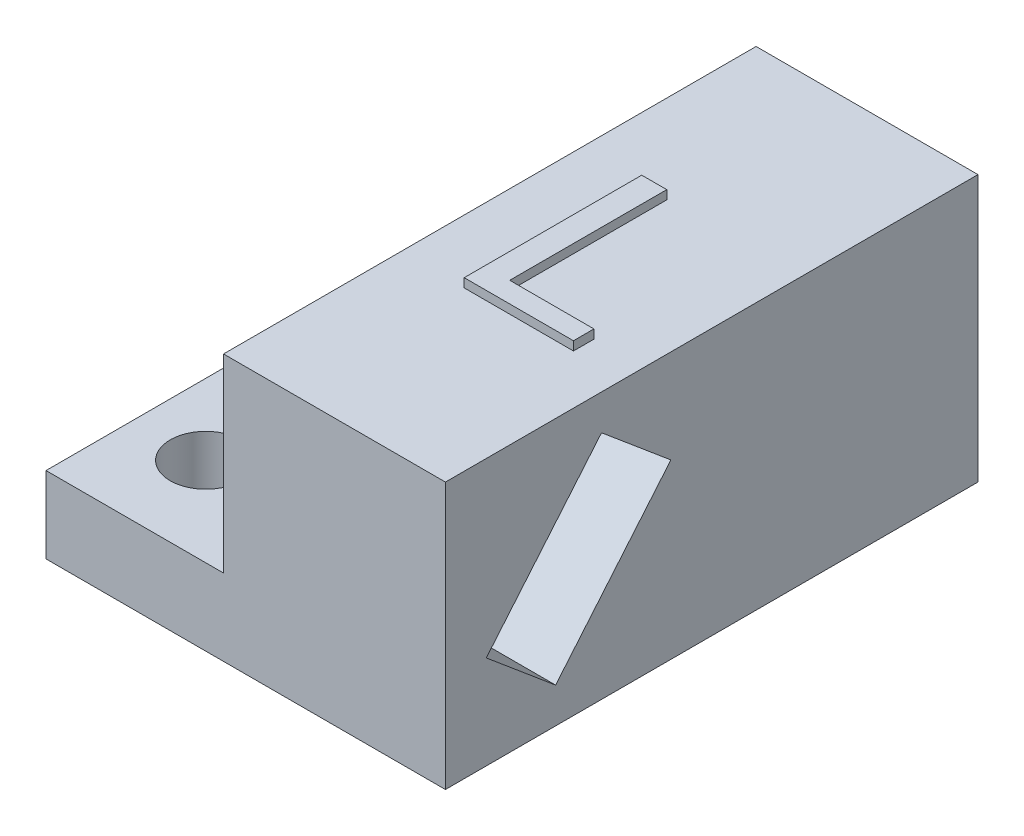
ISO-10303-21;
HEADER;
FILE_DESCRIPTION(('STEP AP214'),'2;1');
FILE_NAME('part.step','',(''),(''),'','','');
FILE_SCHEMA(('AUTOMOTIVE_DESIGN { 1 0 10303 214 1 1 1 1 }'));
ENDSEC;
DATA;
#1=APPLICATION_CONTEXT('core data for automotive mechanical design processes');
#2=APPLICATION_PROTOCOL_DEFINITION('international standard','automotive_design',2000,#1);
#3=PRODUCT_CONTEXT('',#1,'mechanical');
#4=PRODUCT('Part','Part','',(#3));
#5=PRODUCT_RELATED_PRODUCT_CATEGORY('part','',(#4));
#6=PRODUCT_DEFINITION_FORMATION('','',#4);
#7=PRODUCT_DEFINITION_CONTEXT('part definition',#1,'design');
#8=PRODUCT_DEFINITION('design','',#6,#7);
#9=PRODUCT_DEFINITION_SHAPE('','',#8);
#10=(LENGTH_UNIT() NAMED_UNIT(*) SI_UNIT(.MILLI.,.METRE.));
#11=(NAMED_UNIT(*) PLANE_ANGLE_UNIT() SI_UNIT($,.RADIAN.));
#12=(NAMED_UNIT(*) SI_UNIT($,.STERADIAN.) SOLID_ANGLE_UNIT());
#13=UNCERTAINTY_MEASURE_WITH_UNIT(LENGTH_MEASURE(1.E-05),#10,'distance_accuracy_value','');
#14=(GEOMETRIC_REPRESENTATION_CONTEXT(3) GLOBAL_UNCERTAINTY_ASSIGNED_CONTEXT((#13)) GLOBAL_UNIT_ASSIGNED_CONTEXT((#10,
#11,#12)) REPRESENTATION_CONTEXT('',''));
#15=CARTESIAN_POINT('',(0.,0.,0.));
#16=DIRECTION('',(0.,0.,1.));
#17=DIRECTION('',(1.,0.,0.));
#18=AXIS2_PLACEMENT_3D('',#15,#16,#17);
#19=CARTESIAN_POINT('',(-12.5,30.,30.));
#20=DIRECTION('',(1.,0.,0.));
#21=DIRECTION('',(0.,0.,-1.));
#22=AXIS2_PLACEMENT_3D('',#19,#20,#21);
#23=PLANE('',#22);
#24=DIRECTION('',(0.,0.,-1.));
#25=VECTOR('',#24,1.);
#26=CARTESIAN_POINT('',(-12.5,8.62381330552437,30.));
#27=LINE('',#26,#25);
#28=CARTESIAN_POINT('',(-12.5,8.62381330552437,30.));
#29=VERTEX_POINT('',#28);
#30=CARTESIAN_POINT('',(-12.5,8.62381330552437,-30.));
#31=VERTEX_POINT('',#30);
#32=EDGE_CURVE('E243',#29,#31,#27,.T.);
#33=ORIENTED_EDGE('',*,*,#32,.F.);
#34=DIRECTION('',(0.,-1.,0.));
#35=VECTOR('',#34,1.);
#36=CARTESIAN_POINT('',(-12.5,30.,30.));
#37=LINE('',#36,#35);
#38=CARTESIAN_POINT('',(-12.5,30.,30.));
#39=VERTEX_POINT('',#38);
#40=EDGE_CURVE('E11',#39,#29,#37,.T.);
#41=ORIENTED_EDGE('',*,*,#40,.F.);
#42=DIRECTION('',(0.,0.,1.));
#43=VECTOR('',#42,1.);
#44=CARTESIAN_POINT('',(-12.5,30.,30.));
#45=LINE('',#44,#43);
#46=CARTESIAN_POINT('',(-12.5,30.,-30.));
#47=VERTEX_POINT('',#46);
#48=EDGE_CURVE('E265',#47,#39,#45,.T.);
#49=ORIENTED_EDGE('',*,*,#48,.F.);
#50=DIRECTION('',(0.,-1.,0.));
#51=VECTOR('',#50,1.);
#52=CARTESIAN_POINT('',(-12.5,30.,-30.));
#53=LINE('',#52,#51);
#54=EDGE_CURVE('E275',#47,#31,#53,.T.);
#55=ORIENTED_EDGE('',*,*,#54,.T.);
#56=EDGE_LOOP('',(#33,#41,#49,#55));
#57=FACE_BOUND('',#56,.T.);
#58=ADVANCED_FACE('F35',(#57),#23,.F.);
#59=CARTESIAN_POINT('',(12.5,30.,30.));
#60=DIRECTION('',(0.,0.,-1.));
#61=DIRECTION('',(-1.,0.,0.));
#62=AXIS2_PLACEMENT_3D('',#59,#60,#61);
#63=PLANE('',#62);
#64=DIRECTION('',(1.,0.,0.));
#65=VECTOR('',#64,1.);
#66=CARTESIAN_POINT('',(12.5,0.,30.));
#67=LINE('',#66,#65);
#68=CARTESIAN_POINT('',(-32.5,0.,30.));
#69=VERTEX_POINT('',#68);
#70=CARTESIAN_POINT('',(12.5,0.,30.));
#71=VERTEX_POINT('',#70);
#72=EDGE_CURVE('E264',#69,#71,#67,.T.);
#73=ORIENTED_EDGE('',*,*,#72,.T.);
#74=DIRECTION('',(0.,-1.,0.));
#75=VECTOR('',#74,1.);
#76=CARTESIAN_POINT('',(12.5,30.,30.));
#77=LINE('',#76,#75);
#78=CARTESIAN_POINT('',(12.5,30.,30.));
#79=VERTEX_POINT('',#78);
#80=EDGE_CURVE('E42',#79,#71,#77,.T.);
#81=ORIENTED_EDGE('',*,*,#80,.F.);
#82=DIRECTION('',(1.,0.,0.));
#83=VECTOR('',#82,1.);
#84=CARTESIAN_POINT('',(12.5,30.,30.));
#85=LINE('',#84,#83);
#86=EDGE_CURVE('E268',#39,#79,#85,.T.);
#87=ORIENTED_EDGE('',*,*,#86,.F.);
#88=ORIENTED_EDGE('',*,*,#40,.T.);
#89=DIRECTION('',(1.,0.,0.));
#90=VECTOR('',#89,1.);
#91=CARTESIAN_POINT('',(-32.5,8.62381330552437,30.));
#92=LINE('',#91,#90);
#93=CARTESIAN_POINT('',(-32.5,8.62381330552437,30.));
#94=VERTEX_POINT('',#93);
#95=EDGE_CURVE('E261',#94,#29,#92,.T.);
#96=ORIENTED_EDGE('',*,*,#95,.F.);
#97=DIRECTION('',(0.,1.,0.));
#98=VECTOR('',#97,1.);
#99=CARTESIAN_POINT('',(-32.5,8.62381330552437,30.));
#100=LINE('',#99,#98);
#101=EDGE_CURVE('E252',#69,#94,#100,.T.);
#102=ORIENTED_EDGE('',*,*,#101,.F.);
#103=EDGE_LOOP('',(#73,#81,#87,#88,#96,#102));
#104=FACE_BOUND('',#103,.T.);
#105=ADVANCED_FACE('F304',(#104),#63,.F.);
#106=CARTESIAN_POINT('',(12.5,30.,30.));
#107=DIRECTION('',(-1.,0.,0.));
#108=DIRECTION('',(0.,0.,1.));
#109=AXIS2_PLACEMENT_3D('',#106,#107,#108);
#110=PLANE('',#109);
#111=DIRECTION('',(0.,0.766044443118982,-0.642787609686535));
#112=VECTOR('',#111,1.);
#113=CARTESIAN_POINT('',(12.5,3.98473431509697,17.5853281979272));
#114=LINE('',#113,#112);
#115=CARTESIAN_POINT('',(12.5,3.98473431509697,17.5853281979272));
#116=VERTEX_POINT('',#115);
#117=CARTESIAN_POINT('',(12.5,19.4588320661004,4.60101848225919));
#118=VERTEX_POINT('',#117);
#119=EDGE_CURVE('E217',#116,#118,#114,.T.);
#120=ORIENTED_EDGE('',*,*,#119,.F.);
#121=DIRECTION('',(0.,-0.642787609686535,-0.766044443118982));
#122=VECTOR('',#121,1.);
#123=CARTESIAN_POINT('',(12.5,3.98473431509697,17.5853281979272));
#124=LINE('',#123,#122);
#125=CARTESIAN_POINT('',(12.5,10.5411679338996,25.3989815177408));
#126=VERTEX_POINT('',#125);
#127=EDGE_CURVE('E192',#126,#116,#124,.T.);
#128=ORIENTED_EDGE('',*,*,#127,.F.);
#129=DIRECTION('',(0.,-0.766044443118982,0.642787609686535));
#130=VECTOR('',#129,1.);
#131=CARTESIAN_POINT('',(12.5,10.5411679338996,25.3989815177408));
#132=LINE('',#131,#130);
#133=CARTESIAN_POINT('',(12.5,26.015265684903,12.4146718020728));
#134=VERTEX_POINT('',#133);
#135=EDGE_CURVE('E206',#134,#126,#132,.T.);
#136=ORIENTED_EDGE('',*,*,#135,.F.);
#137=DIRECTION('',(0.,0.642787609686535,0.766044443118982));
#138=VECTOR('',#137,1.);
#139=CARTESIAN_POINT('',(12.5,19.4588320661004,4.60101848225919));
#140=LINE('',#139,#138);
#141=EDGE_CURVE('E220',#118,#134,#140,.T.);
#142=ORIENTED_EDGE('',*,*,#141,.F.);
#143=EDGE_LOOP('',(#120,#128,#136,#142));
#144=FACE_BOUND('',#143,.T.);
#145=DIRECTION('',(0.,0.,-1.));
#146=VECTOR('',#145,1.);
#147=CARTESIAN_POINT('',(12.5,0.,30.));
#148=LINE('',#147,#146);
#149=CARTESIAN_POINT('',(12.5,0.,-30.));
#150=VERTEX_POINT('',#149);
#151=EDGE_CURVE('E277',#71,#150,#148,.T.);
#152=ORIENTED_EDGE('',*,*,#151,.T.);
#153=DIRECTION('',(0.,-1.,0.));
#154=VECTOR('',#153,1.);
#155=CARTESIAN_POINT('',(12.5,30.,-30.));
#156=LINE('',#155,#154);
#157=CARTESIAN_POINT('',(12.5,30.,-30.));
#158=VERTEX_POINT('',#157);
#159=EDGE_CURVE('E281',#158,#150,#156,.T.);
#160=ORIENTED_EDGE('',*,*,#159,.F.);
#161=DIRECTION('',(0.,0.,-1.));
#162=VECTOR('',#161,1.);
#163=CARTESIAN_POINT('',(12.5,30.,30.));
#164=LINE('',#163,#162);
#165=EDGE_CURVE('E271',#79,#158,#164,.T.);
#166=ORIENTED_EDGE('',*,*,#165,.F.);
#167=ORIENTED_EDGE('',*,*,#80,.T.);
#168=EDGE_LOOP('',(#152,#160,#166,#167));
#169=FACE_BOUND('',#168,.T.);
#170=ADVANCED_FACE('F288',(#144,#169),#110,.F.);
#171=CARTESIAN_POINT('',(12.5,30.,-30.));
#172=DIRECTION('',(0.,0.,1.));
#173=DIRECTION('',(1.,0.,0.));
#174=AXIS2_PLACEMENT_3D('',#171,#172,#173);
#175=PLANE('',#174);
#176=DIRECTION('',(-1.,0.,0.));
#177=VECTOR('',#176,1.);
#178=CARTESIAN_POINT('',(12.5,0.,-30.));
#179=LINE('',#178,#177);
#180=CARTESIAN_POINT('',(-32.5,0.,-30.));
#181=VERTEX_POINT('',#180);
#182=EDGE_CURVE('E269',#150,#181,#179,.T.);
#183=ORIENTED_EDGE('',*,*,#182,.T.);
#184=DIRECTION('',(0.,-1.,0.));
#185=VECTOR('',#184,1.);
#186=CARTESIAN_POINT('',(-32.5,8.62381330552437,-30.));
#187=LINE('',#186,#185);
#188=CARTESIAN_POINT('',(-32.5,8.62381330552437,-30.));
#189=VERTEX_POINT('',#188);
#190=EDGE_CURVE('E246',#189,#181,#187,.T.);
#191=ORIENTED_EDGE('',*,*,#190,.F.);
#192=DIRECTION('',(1.,0.,0.));
#193=VECTOR('',#192,1.);
#194=CARTESIAN_POINT('',(-32.5,8.62381330552437,-30.));
#195=LINE('',#194,#193);
#196=EDGE_CURVE('E256',#189,#31,#195,.T.);
#197=ORIENTED_EDGE('',*,*,#196,.T.);
#198=ORIENTED_EDGE('',*,*,#54,.F.);
#199=DIRECTION('',(-1.,0.,0.));
#200=VECTOR('',#199,1.);
#201=CARTESIAN_POINT('',(12.5,30.,-30.));
#202=LINE('',#201,#200);
#203=EDGE_CURVE('E273',#158,#47,#202,.T.);
#204=ORIENTED_EDGE('',*,*,#203,.F.);
#205=ORIENTED_EDGE('',*,*,#159,.T.);
#206=EDGE_LOOP('',(#183,#191,#197,#198,#204,#205));
#207=FACE_BOUND('',#206,.T.);
#208=ADVANCED_FACE('F297',(#207),#175,.F.);
#209=CARTESIAN_POINT('',(0.,30.,0.));
#210=DIRECTION('',(0.,1.,0.));
#211=DIRECTION('',(0.,0.,1.));
#212=AXIS2_PLACEMENT_3D('',#209,#210,#211);
#213=PLANE('',#212);
#214=DIRECTION('',(-1.,0.,0.));
#215=VECTOR('',#214,1.);
#216=CARTESIAN_POINT('',(6.92307692307692,30.,10.));
#217=LINE('',#216,#215);
#218=CARTESIAN_POINT('',(6.92307692307692,30.,10.));
#219=VERTEX_POINT('',#218);
#220=CARTESIAN_POINT('',(-5.38461538461539,30.,10.));
#221=VERTEX_POINT('',#220);
#222=EDGE_CURVE('E183',#219,#221,#217,.T.);
#223=ORIENTED_EDGE('',*,*,#222,.T.);
#224=DIRECTION('',(0.,0.,-1.));
#225=VECTOR('',#224,1.);
#226=CARTESIAN_POINT('',(-5.38461538461539,30.,10.));
#227=LINE('',#226,#225);
#228=CARTESIAN_POINT('',(-5.38461538461539,30.,-10.));
#229=VERTEX_POINT('',#228);
#230=EDGE_CURVE('E152',#221,#229,#227,.T.);
#231=ORIENTED_EDGE('',*,*,#230,.T.);
#232=DIRECTION('',(1.,0.,0.));
#233=VECTOR('',#232,1.);
#234=CARTESIAN_POINT('',(-5.38461538461539,30.,-10.));
#235=LINE('',#234,#233);
#236=CARTESIAN_POINT('',(-2.56410256410257,30.,-10.));
#237=VERTEX_POINT('',#236);
#238=EDGE_CURVE('E186',#229,#237,#235,.T.);
#239=ORIENTED_EDGE('',*,*,#238,.T.);
#240=DIRECTION('',(0.,0.,1.));
#241=VECTOR('',#240,1.);
#242=CARTESIAN_POINT('',(-2.56410256410257,30.,-10.));
#243=LINE('',#242,#241);
#244=CARTESIAN_POINT('',(-2.56410256410257,30.,7.69230769230769));
#245=VERTEX_POINT('',#244);
#246=EDGE_CURVE('E188',#237,#245,#243,.T.);
#247=ORIENTED_EDGE('',*,*,#246,.T.);
#248=DIRECTION('',(1.,0.,0.));
#249=VECTOR('',#248,1.);
#250=CARTESIAN_POINT('',(-2.56410256410257,30.,7.69230769230769));
#251=LINE('',#250,#249);
#252=CARTESIAN_POINT('',(6.92307692307692,30.,7.69230769230769));
#253=VERTEX_POINT('',#252);
#254=EDGE_CURVE('E54',#245,#253,#251,.T.);
#255=ORIENTED_EDGE('',*,*,#254,.T.);
#256=DIRECTION('',(0.,0.,1.));
#257=VECTOR('',#256,1.);
#258=CARTESIAN_POINT('',(6.92307692307692,30.,7.69230769230769));
#259=LINE('',#258,#257);
#260=EDGE_CURVE('E49',#253,#219,#259,.T.);
#261=ORIENTED_EDGE('',*,*,#260,.T.);
#262=EDGE_LOOP('',(#223,#231,#239,#247,#255,#261));
#263=FACE_BOUND('',#262,.T.);
#264=ORIENTED_EDGE('',*,*,#48,.T.);
#265=ORIENTED_EDGE('',*,*,#86,.T.);
#266=ORIENTED_EDGE('',*,*,#165,.T.);
#267=ORIENTED_EDGE('',*,*,#203,.T.);
#268=EDGE_LOOP('',(#264,#265,#266,#267));
#269=FACE_BOUND('',#268,.T.);
#270=ADVANCED_FACE('F302',(#263,#269),#213,.T.);
#271=CARTESIAN_POINT('',(0.,0.,0.));
#272=DIRECTION('',(0.,1.,0.));
#273=DIRECTION('',(0.,0.,1.));
#274=AXIS2_PLACEMENT_3D('',#271,#272,#273);
#275=PLANE('',#274);
#276=CARTESIAN_POINT('',(-24.5,0.,20.));
#277=DIRECTION('',(0.,1.,0.));
#278=DIRECTION('',(0.,0.,1.));
#279=AXIS2_PLACEMENT_3D('',#276,#277,#278);
#280=CIRCLE('',#279,4.);
#281=CARTESIAN_POINT('',(-24.5,0.,24.));
#282=VERTEX_POINT('',#281);
#283=EDGE_CURVE('E234',#282,#282,#280,.T.);
#284=ORIENTED_EDGE('',*,*,#283,.T.);
#285=EDGE_LOOP('',(#284));
#286=FACE_BOUND('',#285,.T.);
#287=CARTESIAN_POINT('',(-24.5,0.,-20.));
#288=DIRECTION('',(0.,1.,0.));
#289=DIRECTION('',(0.,0.,1.));
#290=AXIS2_PLACEMENT_3D('',#287,#288,#289);
#291=CIRCLE('',#290,4.);
#292=CARTESIAN_POINT('',(-24.5,0.,-16.));
#293=VERTEX_POINT('',#292);
#294=EDGE_CURVE('E240',#293,#293,#291,.T.);
#295=ORIENTED_EDGE('',*,*,#294,.T.);
#296=EDGE_LOOP('',(#295));
#297=FACE_BOUND('',#296,.T.);
#298=ORIENTED_EDGE('',*,*,#72,.F.);
#299=DIRECTION('',(0.,0.,1.));
#300=VECTOR('',#299,1.);
#301=CARTESIAN_POINT('',(-32.5,0.,30.));
#302=LINE('',#301,#300);
#303=EDGE_CURVE('E249',#181,#69,#302,.T.);
#304=ORIENTED_EDGE('',*,*,#303,.F.);
#305=ORIENTED_EDGE('',*,*,#182,.F.);
#306=ORIENTED_EDGE('',*,*,#151,.F.);
#307=EDGE_LOOP('',(#298,#304,#305,#306));
#308=FACE_BOUND('',#307,.T.);
#309=ADVANCED_FACE('F293',(#286,#297,#308),#275,.F.);
#310=CARTESIAN_POINT('',(-32.5,8.62381330552437,30.));
#311=DIRECTION('',(0.,-1.,0.));
#312=DIRECTION('',(0.,0.,-1.));
#313=AXIS2_PLACEMENT_3D('',#310,#311,#312);
#314=PLANE('',#313);
#315=CARTESIAN_POINT('',(-24.5,8.62381330552437,20.));
#316=DIRECTION('',(0.,1.,0.));
#317=DIRECTION('',(0.,0.,1.));
#318=AXIS2_PLACEMENT_3D('',#315,#316,#317);
#319=CIRCLE('',#318,4.);
#320=CARTESIAN_POINT('',(-24.5,8.62381330552437,24.));
#321=VERTEX_POINT('',#320);
#322=EDGE_CURVE('E227',#321,#321,#319,.T.);
#323=ORIENTED_EDGE('',*,*,#322,.F.);
#324=EDGE_LOOP('',(#323));
#325=FACE_BOUND('',#324,.T.);
#326=CARTESIAN_POINT('',(-24.5,8.62381330552437,-20.));
#327=DIRECTION('',(0.,1.,0.));
#328=DIRECTION('',(0.,0.,1.));
#329=AXIS2_PLACEMENT_3D('',#326,#327,#328);
#330=CIRCLE('',#329,4.);
#331=CARTESIAN_POINT('',(-24.5,8.62381330552437,-16.));
#332=VERTEX_POINT('',#331);
#333=EDGE_CURVE('E237',#332,#332,#330,.T.);
#334=ORIENTED_EDGE('',*,*,#333,.F.);
#335=EDGE_LOOP('',(#334));
#336=FACE_BOUND('',#335,.T.);
#337=ORIENTED_EDGE('',*,*,#32,.T.);
#338=ORIENTED_EDGE('',*,*,#196,.F.);
#339=DIRECTION('',(0.,0.,-1.));
#340=VECTOR('',#339,1.);
#341=CARTESIAN_POINT('',(-32.5,8.62381330552437,30.));
#342=LINE('',#341,#340);
#343=EDGE_CURVE('E254',#94,#189,#342,.T.);
#344=ORIENTED_EDGE('',*,*,#343,.F.);
#345=ORIENTED_EDGE('',*,*,#95,.T.);
#346=EDGE_LOOP('',(#337,#338,#344,#345));
#347=FACE_BOUND('',#346,.T.);
#348=ADVANCED_FACE('F310',(#325,#336,#347),#314,.F.);
#349=CARTESIAN_POINT('',(-32.5,0.,0.));
#350=DIRECTION('',(1.,0.,0.));
#351=DIRECTION('',(0.,0.,-1.));
#352=AXIS2_PLACEMENT_3D('',#349,#350,#351);
#353=PLANE('',#352);
#354=ORIENTED_EDGE('',*,*,#190,.T.);
#355=ORIENTED_EDGE('',*,*,#303,.T.);
#356=ORIENTED_EDGE('',*,*,#101,.T.);
#357=ORIENTED_EDGE('',*,*,#343,.T.);
#358=EDGE_LOOP('',(#354,#355,#356,#357));
#359=FACE_BOUND('',#358,.T.);
#360=ADVANCED_FACE('F313',(#359),#353,.F.);
#361=CARTESIAN_POINT('',(-24.5,0.,-20.));
#362=DIRECTION('',(0.,1.,0.));
#363=DIRECTION('',(0.,0.,1.));
#364=AXIS2_PLACEMENT_3D('',#361,#362,#363);
#365=CYLINDRICAL_SURFACE('',#364,4.);
#366=ORIENTED_EDGE('',*,*,#294,.F.);
#367=EDGE_LOOP('',(#366));
#368=FACE_BOUND('',#367,.T.);
#369=ORIENTED_EDGE('',*,*,#333,.T.);
#370=EDGE_LOOP('',(#369));
#371=FACE_BOUND('',#370,.T.);
#372=ADVANCED_FACE('F315',(#368,#371),#365,.F.);
#373=CARTESIAN_POINT('',(-24.5,0.,20.));
#374=DIRECTION('',(0.,1.,0.));
#375=DIRECTION('',(0.,0.,1.));
#376=AXIS2_PLACEMENT_3D('',#373,#374,#375);
#377=CYLINDRICAL_SURFACE('',#376,4.);
#378=ORIENTED_EDGE('',*,*,#283,.F.);
#379=EDGE_LOOP('',(#378));
#380=FACE_BOUND('',#379,.T.);
#381=ORIENTED_EDGE('',*,*,#322,.T.);
#382=EDGE_LOOP('',(#381));
#383=FACE_BOUND('',#382,.T.);
#384=ADVANCED_FACE('F321',(#380,#383),#377,.F.);
#385=CARTESIAN_POINT('',(-7.5,3.98473431509697,17.5853281979272));
#386=DIRECTION('',(0.,-0.766044443118982,0.642787609686535));
#387=DIRECTION('',(0.,-0.642787609686535,-0.766044443118982));
#388=AXIS2_PLACEMENT_3D('',#385,#386,#387);
#389=PLANE('',#388);
#390=ORIENTED_EDGE('',*,*,#127,.T.);
#391=DIRECTION('',(1.,0.,0.));
#392=VECTOR('',#391,1.);
#393=CARTESIAN_POINT('',(-7.5,3.98473431509697,17.5853281979272));
#394=LINE('',#393,#392);
#395=CARTESIAN_POINT('',(-7.5,3.98473431509697,17.5853281979272));
#396=VERTEX_POINT('',#395);
#397=EDGE_CURVE('E215',#396,#116,#394,.T.);
#398=ORIENTED_EDGE('',*,*,#397,.F.);
#399=DIRECTION('',(0.,-0.642787609686535,-0.766044443118982));
#400=VECTOR('',#399,1.);
#401=CARTESIAN_POINT('',(-7.5,3.98473431509697,17.5853281979272));
#402=LINE('',#401,#400);
#403=CARTESIAN_POINT('',(-7.5,10.5411679338996,25.3989815177408));
#404=VERTEX_POINT('',#403);
#405=EDGE_CURVE('E202',#404,#396,#402,.T.);
#406=ORIENTED_EDGE('',*,*,#405,.F.);
#407=DIRECTION('',(1.,0.,0.));
#408=VECTOR('',#407,1.);
#409=CARTESIAN_POINT('',(-7.5,10.5411679338996,25.3989815177408));
#410=LINE('',#409,#408);
#411=EDGE_CURVE('E225',#404,#126,#410,.T.);
#412=ORIENTED_EDGE('',*,*,#411,.T.);
#413=EDGE_LOOP('',(#390,#398,#406,#412));
#414=FACE_BOUND('',#413,.T.);
#415=ADVANCED_FACE('F380',(#414),#389,.F.);
#416=CARTESIAN_POINT('',(-7.5,10.5411679338996,25.3989815177408));
#417=DIRECTION('',(0.,0.642787609686535,0.766044443118982));
#418=DIRECTION('',(0.,-0.766044443118982,0.642787609686535));
#419=AXIS2_PLACEMENT_3D('',#416,#417,#418);
#420=PLANE('',#419);
#421=ORIENTED_EDGE('',*,*,#135,.T.);
#422=ORIENTED_EDGE('',*,*,#411,.F.);
#423=DIRECTION('',(0.,-0.766044443118982,0.642787609686535));
#424=VECTOR('',#423,1.);
#425=CARTESIAN_POINT('',(-7.5,10.5411679338996,25.3989815177408));
#426=LINE('',#425,#424);
#427=CARTESIAN_POINT('',(-7.5,26.015265684903,12.4146718020728));
#428=VERTEX_POINT('',#427);
#429=EDGE_CURVE('E212',#428,#404,#426,.T.);
#430=ORIENTED_EDGE('',*,*,#429,.F.);
#431=DIRECTION('',(1.,0.,0.));
#432=VECTOR('',#431,1.);
#433=CARTESIAN_POINT('',(-7.5,26.015265684903,12.4146718020728));
#434=LINE('',#433,#432);
#435=EDGE_CURVE('E228',#428,#134,#434,.T.);
#436=ORIENTED_EDGE('',*,*,#435,.T.);
#437=EDGE_LOOP('',(#421,#422,#430,#436));
#438=FACE_BOUND('',#437,.T.);
#439=ADVANCED_FACE('F376',(#438),#420,.F.);
#440=CARTESIAN_POINT('',(-7.5,19.4588320661004,4.60101848225919));
#441=DIRECTION('',(0.,0.766044443118982,-0.642787609686535));
#442=DIRECTION('',(0.,0.642787609686535,0.766044443118982));
#443=AXIS2_PLACEMENT_3D('',#440,#441,#442);
#444=PLANE('',#443);
#445=ORIENTED_EDGE('',*,*,#141,.T.);
#446=ORIENTED_EDGE('',*,*,#435,.F.);
#447=DIRECTION('',(0.,0.642787609686535,0.766044443118982));
#448=VECTOR('',#447,1.);
#449=CARTESIAN_POINT('',(-7.5,19.4588320661004,4.60101848225919));
#450=LINE('',#449,#448);
#451=CARTESIAN_POINT('',(-7.5,19.4588320661004,4.60101848225919));
#452=VERTEX_POINT('',#451);
#453=EDGE_CURVE('E209',#452,#428,#450,.T.);
#454=ORIENTED_EDGE('',*,*,#453,.F.);
#455=DIRECTION('',(1.,0.,0.));
#456=VECTOR('',#455,1.);
#457=CARTESIAN_POINT('',(-7.5,19.4588320661004,4.60101848225919));
#458=LINE('',#457,#456);
#459=EDGE_CURVE('E230',#452,#118,#458,.T.);
#460=ORIENTED_EDGE('',*,*,#459,.T.);
#461=EDGE_LOOP('',(#445,#446,#454,#460));
#462=FACE_BOUND('',#461,.T.);
#463=ADVANCED_FACE('F379',(#462),#444,.F.);
#464=CARTESIAN_POINT('',(-7.5,3.98473431509697,17.5853281979272));
#465=DIRECTION('',(0.,-0.642787609686535,-0.766044443118982));
#466=DIRECTION('',(0.,0.766044443118982,-0.642787609686535));
#467=AXIS2_PLACEMENT_3D('',#464,#465,#466);
#468=PLANE('',#467);
#469=ORIENTED_EDGE('',*,*,#119,.T.);
#470=ORIENTED_EDGE('',*,*,#459,.F.);
#471=DIRECTION('',(0.,0.766044443118982,-0.642787609686535));
#472=VECTOR('',#471,1.);
#473=CARTESIAN_POINT('',(-7.5,3.98473431509697,17.5853281979272));
#474=LINE('',#473,#472);
#475=EDGE_CURVE('E205',#396,#452,#474,.T.);
#476=ORIENTED_EDGE('',*,*,#475,.F.);
#477=ORIENTED_EDGE('',*,*,#397,.T.);
#478=EDGE_LOOP('',(#469,#470,#476,#477));
#479=FACE_BOUND('',#478,.T.);
#480=ADVANCED_FACE('F374',(#479),#468,.F.);
#481=CARTESIAN_POINT('',(-7.5,0.,0.));
#482=DIRECTION('',(-1.,0.,0.));
#483=DIRECTION('',(0.,0.,1.));
#484=AXIS2_PLACEMENT_3D('',#481,#482,#483);
#485=PLANE('',#484);
#486=ORIENTED_EDGE('',*,*,#405,.T.);
#487=ORIENTED_EDGE('',*,*,#475,.T.);
#488=ORIENTED_EDGE('',*,*,#453,.T.);
#489=ORIENTED_EDGE('',*,*,#429,.T.);
#490=EDGE_LOOP('',(#486,#487,#488,#489));
#491=FACE_BOUND('',#490,.T.);
#492=ADVANCED_FACE('F362',(#491),#485,.F.);
#493=CARTESIAN_POINT('',(6.92307692307692,31.,10.));
#494=DIRECTION('',(0.,0.,1.));
#495=DIRECTION('',(1.,0.,0.));
#496=AXIS2_PLACEMENT_3D('',#493,#494,#495);
#497=PLANE('',#496);
#498=ORIENTED_EDGE('',*,*,#222,.F.);
#499=DIRECTION('',(0.,-1.,0.));
#500=VECTOR('',#499,1.);
#501=CARTESIAN_POINT('',(6.92307692307692,31.,10.));
#502=LINE('',#501,#500);
#503=CARTESIAN_POINT('',(6.92307692307692,31.,10.));
#504=VERTEX_POINT('',#503);
#505=EDGE_CURVE('E171',#504,#219,#502,.T.);
#506=ORIENTED_EDGE('',*,*,#505,.F.);
#507=DIRECTION('',(-1.,0.,0.));
#508=VECTOR('',#507,1.);
#509=CARTESIAN_POINT('',(6.92307692307692,31.,10.));
#510=LINE('',#509,#508);
#511=CARTESIAN_POINT('',(-5.38461538461539,31.,10.));
#512=VERTEX_POINT('',#511);
#513=EDGE_CURVE('E164',#504,#512,#510,.T.);
#514=ORIENTED_EDGE('',*,*,#513,.T.);
#515=DIRECTION('',(0.,-1.,0.));
#516=VECTOR('',#515,1.);
#517=CARTESIAN_POINT('',(-5.38461538461539,31.,10.));
#518=LINE('',#517,#516);
#519=EDGE_CURVE('E147',#512,#221,#518,.T.);
#520=ORIENTED_EDGE('',*,*,#519,.T.);
#521=EDGE_LOOP('',(#498,#506,#514,#520));
#522=FACE_BOUND('',#521,.T.);
#523=ADVANCED_FACE('F170',(#522),#497,.T.);
#524=CARTESIAN_POINT('',(6.92307692307692,31.,7.69230769230769));
#525=DIRECTION('',(1.,0.,0.));
#526=DIRECTION('',(0.,0.,-1.));
#527=AXIS2_PLACEMENT_3D('',#524,#525,#526);
#528=PLANE('',#527);
#529=ORIENTED_EDGE('',*,*,#260,.F.);
#530=DIRECTION('',(0.,-1.,0.));
#531=VECTOR('',#530,1.);
#532=CARTESIAN_POINT('',(6.92307692307692,31.,7.69230769230769));
#533=LINE('',#532,#531);
#534=CARTESIAN_POINT('',(6.92307692307692,31.,7.69230769230769));
#535=VERTEX_POINT('',#534);
#536=EDGE_CURVE('E193',#535,#253,#533,.T.);
#537=ORIENTED_EDGE('',*,*,#536,.F.);
#538=DIRECTION('',(0.,0.,1.));
#539=VECTOR('',#538,1.);
#540=CARTESIAN_POINT('',(6.92307692307692,31.,7.69230769230769));
#541=LINE('',#540,#539);
#542=EDGE_CURVE('E157',#535,#504,#541,.T.);
#543=ORIENTED_EDGE('',*,*,#542,.T.);
#544=ORIENTED_EDGE('',*,*,#505,.T.);
#545=EDGE_LOOP('',(#529,#537,#543,#544));
#546=FACE_BOUND('',#545,.T.);
#547=ADVANCED_FACE('F354',(#546),#528,.T.);
#548=CARTESIAN_POINT('',(-2.56410256410257,31.,7.69230769230769));
#549=DIRECTION('',(0.,0.,-1.));
#550=DIRECTION('',(-1.,0.,0.));
#551=AXIS2_PLACEMENT_3D('',#548,#549,#550);
#552=PLANE('',#551);
#553=ORIENTED_EDGE('',*,*,#254,.F.);
#554=DIRECTION('',(0.,-1.,0.));
#555=VECTOR('',#554,1.);
#556=CARTESIAN_POINT('',(-2.56410256410257,31.,7.69230769230769));
#557=LINE('',#556,#555);
#558=CARTESIAN_POINT('',(-2.56410256410257,31.,7.69230769230769));
#559=VERTEX_POINT('',#558);
#560=EDGE_CURVE('E195',#559,#245,#557,.T.);
#561=ORIENTED_EDGE('',*,*,#560,.F.);
#562=DIRECTION('',(1.,0.,0.));
#563=VECTOR('',#562,1.);
#564=CARTESIAN_POINT('',(-2.56410256410257,31.,7.69230769230769));
#565=LINE('',#564,#563);
#566=EDGE_CURVE('E179',#559,#535,#565,.T.);
#567=ORIENTED_EDGE('',*,*,#566,.T.);
#568=ORIENTED_EDGE('',*,*,#536,.T.);
#569=EDGE_LOOP('',(#553,#561,#567,#568));
#570=FACE_BOUND('',#569,.T.);
#571=ADVANCED_FACE('F352',(#570),#552,.T.);
#572=CARTESIAN_POINT('',(-2.56410256410257,31.,-10.));
#573=DIRECTION('',(1.,0.,0.));
#574=DIRECTION('',(0.,0.,-1.));
#575=AXIS2_PLACEMENT_3D('',#572,#573,#574);
#576=PLANE('',#575);
#577=ORIENTED_EDGE('',*,*,#246,.F.);
#578=DIRECTION('',(0.,-1.,0.));
#579=VECTOR('',#578,1.);
#580=CARTESIAN_POINT('',(-2.56410256410257,31.,-10.));
#581=LINE('',#580,#579);
#582=CARTESIAN_POINT('',(-2.56410256410257,31.,-10.));
#583=VERTEX_POINT('',#582);
#584=EDGE_CURVE('E198',#583,#237,#581,.T.);
#585=ORIENTED_EDGE('',*,*,#584,.F.);
#586=DIRECTION('',(0.,0.,1.));
#587=VECTOR('',#586,1.);
#588=CARTESIAN_POINT('',(-2.56410256410257,31.,-10.));
#589=LINE('',#588,#587);
#590=EDGE_CURVE('E176',#583,#559,#589,.T.);
#591=ORIENTED_EDGE('',*,*,#590,.T.);
#592=ORIENTED_EDGE('',*,*,#560,.T.);
#593=EDGE_LOOP('',(#577,#585,#591,#592));
#594=FACE_BOUND('',#593,.T.);
#595=ADVANCED_FACE('F349',(#594),#576,.T.);
#596=CARTESIAN_POINT('',(-5.38461538461539,31.,-10.));
#597=DIRECTION('',(0.,0.,-1.));
#598=DIRECTION('',(-1.,0.,0.));
#599=AXIS2_PLACEMENT_3D('',#596,#597,#598);
#600=PLANE('',#599);
#601=ORIENTED_EDGE('',*,*,#238,.F.);
#602=DIRECTION('',(0.,-1.,0.));
#603=VECTOR('',#602,1.);
#604=CARTESIAN_POINT('',(-5.38461538461539,31.,-10.));
#605=LINE('',#604,#603);
#606=CARTESIAN_POINT('',(-5.38461538461539,31.,-10.));
#607=VERTEX_POINT('',#606);
#608=EDGE_CURVE('E156',#607,#229,#605,.T.);
#609=ORIENTED_EDGE('',*,*,#608,.F.);
#610=DIRECTION('',(1.,0.,0.));
#611=VECTOR('',#610,1.);
#612=CARTESIAN_POINT('',(-5.38461538461539,31.,-10.));
#613=LINE('',#612,#611);
#614=EDGE_CURVE('E168',#607,#583,#613,.T.);
#615=ORIENTED_EDGE('',*,*,#614,.T.);
#616=ORIENTED_EDGE('',*,*,#584,.T.);
#617=EDGE_LOOP('',(#601,#609,#615,#616));
#618=FACE_BOUND('',#617,.T.);
#619=ADVANCED_FACE('F346',(#618),#600,.T.);
#620=CARTESIAN_POINT('',(-5.38461538461539,31.,10.));
#621=DIRECTION('',(-1.,0.,0.));
#622=DIRECTION('',(0.,0.,1.));
#623=AXIS2_PLACEMENT_3D('',#620,#621,#622);
#624=PLANE('',#623);
#625=ORIENTED_EDGE('',*,*,#230,.F.);
#626=ORIENTED_EDGE('',*,*,#519,.F.);
#627=DIRECTION('',(0.,0.,-1.));
#628=VECTOR('',#627,1.);
#629=CARTESIAN_POINT('',(-5.38461538461539,31.,10.));
#630=LINE('',#629,#628);
#631=EDGE_CURVE('E151',#512,#607,#630,.T.);
#632=ORIENTED_EDGE('',*,*,#631,.T.);
#633=ORIENTED_EDGE('',*,*,#608,.T.);
#634=EDGE_LOOP('',(#625,#626,#632,#633));
#635=FACE_BOUND('',#634,.T.);
#636=ADVANCED_FACE('F149',(#635),#624,.T.);
#637=CARTESIAN_POINT('',(0.,31.,0.));
#638=DIRECTION('',(0.,-1.,0.));
#639=DIRECTION('',(0.,0.,-1.));
#640=AXIS2_PLACEMENT_3D('',#637,#638,#639);
#641=PLANE('',#640);
#642=ORIENTED_EDGE('',*,*,#513,.F.);
#643=ORIENTED_EDGE('',*,*,#542,.F.);
#644=ORIENTED_EDGE('',*,*,#566,.F.);
#645=ORIENTED_EDGE('',*,*,#590,.F.);
#646=ORIENTED_EDGE('',*,*,#614,.F.);
#647=ORIENTED_EDGE('',*,*,#631,.F.);
#648=EDGE_LOOP('',(#642,#643,#644,#645,#646,#647));
#649=FACE_BOUND('',#648,.T.);
#650=ADVANCED_FACE('F162',(#649),#641,.F.);
#651=CLOSED_SHELL('',(#58,#105,#170,#208,#270,#309,#348,#360,#372,#384,#415,#439,#463,#480,#492,
#523,#547,#571,#595,#619,#636,#650));
#652=MANIFOLD_SOLID_BREP('B2',#651);
#653=ADVANCED_BREP_SHAPE_REPRESENTATION('',(#18,#652),#14);
#654=SHAPE_DEFINITION_REPRESENTATION(#9,#653);
ENDSEC;
END-ISO-10303-21;
